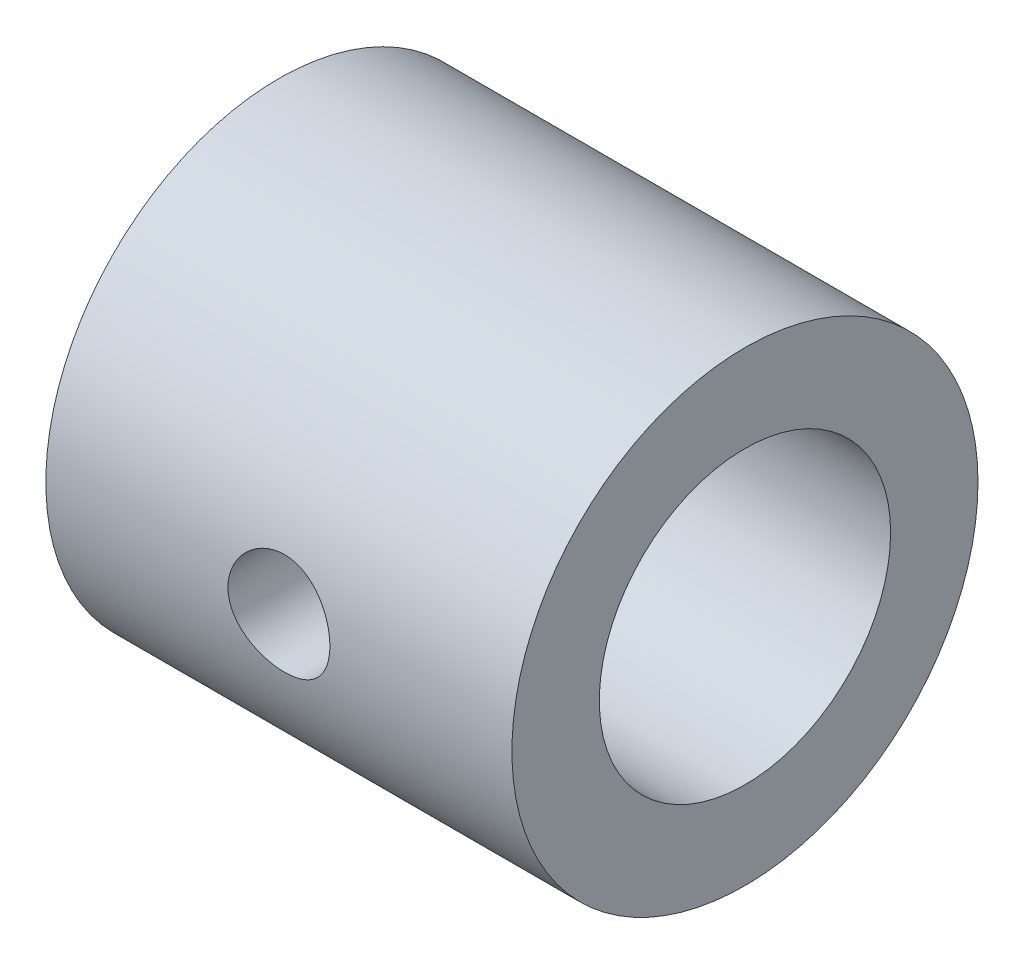
ISO-10303-21;
HEADER;
FILE_DESCRIPTION(('STEP AP214'),'2;1');
FILE_NAME('part.step','',(''),(''),'','','');
FILE_SCHEMA(('AUTOMOTIVE_DESIGN { 1 0 10303 214 1 1 1 1 }'));
ENDSEC;
DATA;
#1=APPLICATION_CONTEXT('core data for automotive mechanical design processes');
#2=APPLICATION_PROTOCOL_DEFINITION('international standard','automotive_design',2000,#1);
#3=PRODUCT_CONTEXT('',#1,'mechanical');
#4=PRODUCT('Part','Part','',(#3));
#5=PRODUCT_RELATED_PRODUCT_CATEGORY('part','',(#4));
#6=PRODUCT_DEFINITION_FORMATION('','',#4);
#7=PRODUCT_DEFINITION_CONTEXT('part definition',#1,'design');
#8=PRODUCT_DEFINITION('design','',#6,#7);
#9=PRODUCT_DEFINITION_SHAPE('','',#8);
#10=(LENGTH_UNIT() NAMED_UNIT(*) SI_UNIT(.MILLI.,.METRE.));
#11=(NAMED_UNIT(*) PLANE_ANGLE_UNIT() SI_UNIT($,.RADIAN.));
#12=(NAMED_UNIT(*) SI_UNIT($,.STERADIAN.) SOLID_ANGLE_UNIT());
#13=UNCERTAINTY_MEASURE_WITH_UNIT(LENGTH_MEASURE(1.E-05),#10,'distance_accuracy_value','');
#14=(GEOMETRIC_REPRESENTATION_CONTEXT(3) GLOBAL_UNCERTAINTY_ASSIGNED_CONTEXT((#13)) GLOBAL_UNIT_ASSIGNED_CONTEXT((#10,
#11,#12)) REPRESENTATION_CONTEXT('',''));
#15=CARTESIAN_POINT('',(0.,0.,0.));
#16=DIRECTION('',(0.,0.,1.));
#17=DIRECTION('',(1.,0.,0.));
#18=AXIS2_PLACEMENT_3D('',#15,#16,#17);
#19=CARTESIAN_POINT('',(6.35,0.,0.));
#20=DIRECTION('',(-1.,0.,0.));
#21=DIRECTION('',(0.,0.,1.));
#22=AXIS2_PLACEMENT_3D('',#19,#20,#21);
#23=CYLINDRICAL_SURFACE('',#22,6.35);
#24=CARTESIAN_POINT('',(1.3890625,0.,-6.35));
#25=CARTESIAN_POINT('',(1.38905986930336,-0.0770408471682831,-6.34999857899858));
#26=CARTESIAN_POINT('',(1.38263154808764,-0.154113483155263,-6.34858371582944));
#27=CARTESIAN_POINT('',(1.35711481436661,-0.306069518531249,-6.3430762080525));
#28=CARTESIAN_POINT('',(1.33801735654758,-0.380951313826296,-6.33898165026606));
#29=CARTESIAN_POINT('',(1.28778913742385,-0.526307623730005,-6.32857064766496));
#30=CARTESIAN_POINT('',(1.25667094696553,-0.596786653438425,-6.32225652460999));
#31=CARTESIAN_POINT('',(1.1833244870091,-0.73152084022531,-6.30808785716228));
#32=CARTESIAN_POINT('',(1.14109650464893,-0.795776158099904,-6.30023335258277));
#33=CARTESIAN_POINT('',(1.04601191719148,-0.917272723348734,-6.28370341003478));
#34=CARTESIAN_POINT('',(0.993011163737974,-0.974399782936221,-6.27501778865132));
#35=CARTESIAN_POINT('',(0.878194988507716,-1.07902809540525,-6.25787628862363));
#36=CARTESIAN_POINT('',(0.816378781488858,-1.12652848987194,-6.24942043052566));
#37=CARTESIAN_POINT('',(0.684842129817846,-1.21105894182183,-6.2335954457377));
#38=CARTESIAN_POINT('',(0.615041852226282,-1.24796743339354,-6.22623936751426));
#39=CARTESIAN_POINT('',(0.470042206653483,-1.30948659380819,-6.21359298291537));
#40=CARTESIAN_POINT('',(0.39484348560998,-1.33409873341496,-6.20830242949951));
#41=CARTESIAN_POINT('',(0.242420223312962,-1.36994915689751,-6.20048981569181));
#42=CARTESIAN_POINT('',(0.16524542191716,-1.38138961213299,-6.19792595162784));
#43=CARTESIAN_POINT('',(0.0100325548732576,-1.39120053912366,-6.19573145355588));
#44=CARTESIAN_POINT('',(-0.0680054034645996,-1.3895726177385,-6.19610045892848));
#45=CARTESIAN_POINT('',(-0.221226328488363,-1.37345569747506,-6.19969216119694));
#46=CARTESIAN_POINT('',(-0.296435406983452,-1.35920156493734,-6.20286274198083));
#47=CARTESIAN_POINT('',(-0.443368202127601,-1.31860894659746,-6.21161795094662));
#48=CARTESIAN_POINT('',(-0.515091722946607,-1.29226978268469,-6.21720271459119));
#49=CARTESIAN_POINT('',(-0.653677679092509,-1.22803912268215,-6.23020838169099));
#50=CARTESIAN_POINT('',(-0.720496865471805,-1.19005732002183,-6.23764354992541));
#51=CARTESIAN_POINT('',(-0.846900228836931,-1.10368304558917,-6.25350352055306));
#52=CARTESIAN_POINT('',(-0.906483417663659,-1.05528915442124,-6.26192845780233));
#53=CARTESIAN_POINT('',(-1.01807562481132,-0.948221191319587,-6.27904229219529));
#54=CARTESIAN_POINT('',(-1.06989294588232,-0.88934740731759,-6.28773295721028));
#55=CARTESIAN_POINT('',(-1.16294992406196,-0.763647218737209,-6.30423308338503));
#56=CARTESIAN_POINT('',(-1.20418938948675,-0.696820670076995,-6.31204252857457));
#57=CARTESIAN_POINT('',(-1.27496741262067,-0.55687789373565,-6.32592565886695));
#58=CARTESIAN_POINT('',(-1.30448084613331,-0.483748565062286,-6.33199560926044));
#59=CARTESIAN_POINT('',(-1.35074728815552,-0.333406298546856,-6.3416880672381));
#60=CARTESIAN_POINT('',(-1.36750215264408,-0.256193956405846,-6.34531093078939));
#61=CARTESIAN_POINT('',(-1.38749701371681,-0.101521759768157,-6.34965034804132));
#62=CARTESIAN_POINT('',(-1.39099887112832,-0.024097291437662,-6.35042320588568));
#63=CARTESIAN_POINT('',(-1.3850980810961,0.130230356866131,-6.34913331284916));
#64=CARTESIAN_POINT('',(-1.37569630910578,0.207133571848407,-6.34707075433855));
#65=CARTESIAN_POINT('',(-1.34447227224844,0.357368057618586,-6.34037731419124));
#66=CARTESIAN_POINT('',(-1.32278735806414,0.430729253025147,-6.33577484832666));
#67=CARTESIAN_POINT('',(-1.26776504916853,0.572772984759519,-6.32451674628277));
#68=CARTESIAN_POINT('',(-1.2344266615851,0.641455121837125,-6.31786093516479));
#69=CARTESIAN_POINT('',(-1.1564981841587,0.773273856447654,-6.30309556357787));
#70=CARTESIAN_POINT('',(-1.11175426656689,0.836317293289701,-6.29496660673028));
#71=CARTESIAN_POINT('',(-1.01248740912607,0.954094899266631,-6.27819624848666));
#72=CARTESIAN_POINT('',(-0.957963198937231,1.00882798728205,-6.26955478061946));
#73=CARTESIAN_POINT('',(-0.839481887748859,1.10946652714324,-6.2525388718201));
#74=CARTESIAN_POINT('',(-0.775369430407147,1.15519065365343,-6.24417228961643));
#75=CARTESIAN_POINT('',(-0.640221621913181,1.23522363853578,-6.22883534751375));
#76=CARTESIAN_POINT('',(-0.569186570476502,1.26953299083004,-6.22186492720743));
#77=CARTESIAN_POINT('',(-0.422590884458291,1.3255308249353,-6.21017608603567));
#78=CARTESIAN_POINT('',(-0.347058412702929,1.34729026638093,-6.2054450311924));
#79=CARTESIAN_POINT('',(-0.193292408816776,1.3777784494499,-6.19874782905592));
#80=CARTESIAN_POINT('',(-0.11505931076456,1.38650927531006,-6.19678123952368));
#81=CARTESIAN_POINT('',(0.0400589152149301,1.39060367444849,-6.19586350318036));
#82=CARTESIAN_POINT('',(0.116936210133745,1.38625475155461,-6.1968474986074));
#83=CARTESIAN_POINT('',(0.268834094583135,1.36495585245806,-6.20157337782062));
#84=CARTESIAN_POINT('',(0.343854705991454,1.34800602480797,-6.20531522909432));
#85=CARTESIAN_POINT('',(0.489681227612941,1.30212537285486,-6.21510358904485));
#86=CARTESIAN_POINT('',(0.560500881292062,1.2732363980058,-6.22114204176945));
#87=CARTESIAN_POINT('',(0.696330912671777,1.20433345118798,-6.23484638338867));
#88=CARTESIAN_POINT('',(0.761340684063724,1.16431831990124,-6.24251244185608));
#89=CARTESIAN_POINT('',(0.885122807803415,1.07334538224577,-6.25880195994543));
#90=CARTESIAN_POINT('',(0.943742472514475,1.0221826878529,-6.2674416430782));
#91=CARTESIAN_POINT('',(1.05165862099773,0.910782131259334,-6.28459592080665));
#92=CARTESIAN_POINT('',(1.10095294642711,0.850542173914802,-6.29311048602432));
#93=CARTESIAN_POINT('',(1.18943146578896,0.721755121796878,-6.30918620130407));
#94=CARTESIAN_POINT('',(1.22847616949484,0.653110375924711,-6.31673354607912));
#95=CARTESIAN_POINT('',(1.29441154342387,0.51008183430329,-6.3298859198831));
#96=CARTESIAN_POINT('',(1.3213124050221,0.435702912410396,-6.3354925766542));
#97=CARTESIAN_POINT('',(1.35740301626477,0.301041738185885,-6.34313167188264));
#98=CARTESIAN_POINT('',(1.36925266606876,0.241487886914347,-6.34569133939321));
#99=CARTESIAN_POINT('',(1.38508326916996,0.121295893746684,-6.34912602552347));
#100=CARTESIAN_POINT('',(1.38906457126838,0.0606578000349113,-6.35000111881973));
#101=CARTESIAN_POINT('',(1.3890625,0.,-6.35));
#102=B_SPLINE_CURVE_WITH_KNOTS('',3,(#24,#25,#26,#27,#28,#29,#30,#31,#32,#33,#34,#35,#36,#37,
#38,#39,#40,#41,#42,#43,#44,#45,#46,#47,#48,#49,#50,#51,#52,#53,#54,#55,#56,#57,#58,#59,#60,#61,
#62,#63,#64,#65,#66,#67,#68,#69,#70,#71,#72,#73,#74,#75,#76,#77,#78,#79,#80,#81,#82,#83,#84,#85,
#86,#87,#88,#89,#90,#91,#92,#93,#94,#95,#96,#97,#98,#99,#100,#101),.UNSPECIFIED.,.T.,.F.,(4,2,2,
2,2,2,2,2,2,2,2,2,2,2,2,2,2,2,2,2,2,2,2,2,2,2,2,2,2,2,2,2,2,2,2,2,2,2,4),(0.,0.230900509144249,
0.4619660507311,0.692790603672132,0.923609191426884,1.15774795204596,1.39190758176553,
1.62865607320934,1.86537624043712,2.09841242042367,2.33141994721875,2.56018212935158,
2.78895714926963,3.01955360668713,3.25018151938973,3.48579772155466,3.72141819307559,
3.95754081719481,4.19362908617659,4.42502746626468,4.65641014778622,4.88525517593931,
5.11411970636799,5.34625135018098,5.57841316690404,5.81485460555447,6.05128581195316,
6.28636674309187,6.5214100634136,6.75132496959778,6.98123716534878,7.21035021078305,
7.43948713818205,7.67325690109678,7.90708070382927,8.14393862784679,8.38059740434398,
8.5624040477739,8.74420263159577),.UNSPECIFIED.);
#103=CARTESIAN_POINT('',(1.3890625,0.,-6.35));
#104=VERTEX_POINT('',#103);
#105=EDGE_CURVE('E386',#104,#104,#102,.T.);
#106=ORIENTED_EDGE('',*,*,#105,.F.);
#107=EDGE_LOOP('',(#106));
#108=FACE_BOUND('',#107,.T.);
#109=CARTESIAN_POINT('',(-6.35,0.,0.));
#110=DIRECTION('',(1.,0.,0.));
#111=DIRECTION('',(0.,0.,-1.));
#112=AXIS2_PLACEMENT_3D('',#109,#110,#111);
#113=CIRCLE('',#112,6.35);
#114=CARTESIAN_POINT('',(-6.35,0.,-6.35));
#115=VERTEX_POINT('',#114);
#116=EDGE_CURVE('E369',#115,#115,#113,.T.);
#117=ORIENTED_EDGE('',*,*,#116,.T.);
#118=EDGE_LOOP('',(#117));
#119=FACE_BOUND('',#118,.T.);
#120=CARTESIAN_POINT('',(6.35,0.,0.));
#121=DIRECTION('',(1.,0.,0.));
#122=DIRECTION('',(0.,0.,-1.));
#123=AXIS2_PLACEMENT_3D('',#120,#121,#122);
#124=CIRCLE('',#123,6.35);
#125=CARTESIAN_POINT('',(6.35,0.,-6.35));
#126=VERTEX_POINT('',#125);
#127=EDGE_CURVE('E10',#126,#126,#124,.T.);
#128=ORIENTED_EDGE('',*,*,#127,.F.);
#129=EDGE_LOOP('',(#128));
#130=FACE_BOUND('',#129,.T.);
#131=CARTESIAN_POINT('',(-1.3890625,0.,6.35));
#132=CARTESIAN_POINT('',(-1.38905986930336,0.0770408471682831,6.34999857899858));
#133=CARTESIAN_POINT('',(-1.38263154808764,0.154113483155263,6.34858371582944));
#134=CARTESIAN_POINT('',(-1.35711481436661,0.306069518531249,6.3430762080525));
#135=CARTESIAN_POINT('',(-1.33801735654758,0.380951313826296,6.33898165026606));
#136=CARTESIAN_POINT('',(-1.28778913742385,0.526307623730005,6.32857064766496));
#137=CARTESIAN_POINT('',(-1.25667094696553,0.596786653438425,6.32225652460999));
#138=CARTESIAN_POINT('',(-1.1833244870091,0.73152084022531,6.30808785716228));
#139=CARTESIAN_POINT('',(-1.14109650464893,0.795776158099904,6.30023335258277));
#140=CARTESIAN_POINT('',(-1.04601191719148,0.917272723348734,6.28370341003478));
#141=CARTESIAN_POINT('',(-0.993011163737974,0.974399782936221,6.27501778865132));
#142=CARTESIAN_POINT('',(-0.878194988507716,1.07902809540525,6.25787628862363));
#143=CARTESIAN_POINT('',(-0.816378781488858,1.12652848987194,6.24942043052566));
#144=CARTESIAN_POINT('',(-0.684842129817846,1.21105894182183,6.2335954457377));
#145=CARTESIAN_POINT('',(-0.615041852226282,1.24796743339354,6.22623936751426));
#146=CARTESIAN_POINT('',(-0.470042206653483,1.30948659380819,6.21359298291537));
#147=CARTESIAN_POINT('',(-0.39484348560998,1.33409873341496,6.20830242949951));
#148=CARTESIAN_POINT('',(-0.242420223312962,1.36994915689751,6.20048981569181));
#149=CARTESIAN_POINT('',(-0.16524542191716,1.38138961213299,6.19792595162784));
#150=CARTESIAN_POINT('',(-0.0100325548732576,1.39120053912366,6.19573145355588));
#151=CARTESIAN_POINT('',(0.0680054034645996,1.3895726177385,6.19610045892848));
#152=CARTESIAN_POINT('',(0.221226328488363,1.37345569747506,6.19969216119694));
#153=CARTESIAN_POINT('',(0.296435406983452,1.35920156493734,6.20286274198083));
#154=CARTESIAN_POINT('',(0.443368202127601,1.31860894659746,6.21161795094662));
#155=CARTESIAN_POINT('',(0.515091722946607,1.29226978268469,6.21720271459119));
#156=CARTESIAN_POINT('',(0.653677679092509,1.22803912268215,6.23020838169099));
#157=CARTESIAN_POINT('',(0.720496865471805,1.19005732002183,6.23764354992541));
#158=CARTESIAN_POINT('',(0.846900228836931,1.10368304558917,6.25350352055306));
#159=CARTESIAN_POINT('',(0.906483417663659,1.05528915442124,6.26192845780233));
#160=CARTESIAN_POINT('',(1.01807562481132,0.948221191319587,6.27904229219529));
#161=CARTESIAN_POINT('',(1.06989294588232,0.88934740731759,6.28773295721028));
#162=CARTESIAN_POINT('',(1.16294992406196,0.763647218737209,6.30423308338503));
#163=CARTESIAN_POINT('',(1.20418938948675,0.696820670076995,6.31204252857457));
#164=CARTESIAN_POINT('',(1.27496741262067,0.55687789373565,6.32592565886695));
#165=CARTESIAN_POINT('',(1.30448084613331,0.483748565062286,6.33199560926044));
#166=CARTESIAN_POINT('',(1.35074728815552,0.333406298546856,6.3416880672381));
#167=CARTESIAN_POINT('',(1.36750215264408,0.256193956405846,6.34531093078939));
#168=CARTESIAN_POINT('',(1.38749701371681,0.101521759768157,6.34965034804132));
#169=CARTESIAN_POINT('',(1.39099887112832,0.024097291437662,6.35042320588568));
#170=CARTESIAN_POINT('',(1.3850980810961,-0.130230356866131,6.34913331284916));
#171=CARTESIAN_POINT('',(1.37569630910578,-0.207133571848407,6.34707075433855));
#172=CARTESIAN_POINT('',(1.34447227224844,-0.357368057618586,6.34037731419124));
#173=CARTESIAN_POINT('',(1.32278735806414,-0.430729253025147,6.33577484832666));
#174=CARTESIAN_POINT('',(1.26776504916853,-0.572772984759519,6.32451674628277));
#175=CARTESIAN_POINT('',(1.2344266615851,-0.641455121837125,6.31786093516479));
#176=CARTESIAN_POINT('',(1.1564981841587,-0.773273856447654,6.30309556357787));
#177=CARTESIAN_POINT('',(1.11175426656689,-0.836317293289701,6.29496660673028));
#178=CARTESIAN_POINT('',(1.01248740912607,-0.954094899266631,6.27819624848666));
#179=CARTESIAN_POINT('',(0.957963198937231,-1.00882798728205,6.26955478061946));
#180=CARTESIAN_POINT('',(0.839481887748859,-1.10946652714324,6.2525388718201));
#181=CARTESIAN_POINT('',(0.775369430407147,-1.15519065365343,6.24417228961643));
#182=CARTESIAN_POINT('',(0.640221621913181,-1.23522363853578,6.22883534751375));
#183=CARTESIAN_POINT('',(0.569186570476502,-1.26953299083004,6.22186492720743));
#184=CARTESIAN_POINT('',(0.422590884458291,-1.3255308249353,6.21017608603567));
#185=CARTESIAN_POINT('',(0.347058412702929,-1.34729026638093,6.2054450311924));
#186=CARTESIAN_POINT('',(0.193292408816776,-1.3777784494499,6.19874782905592));
#187=CARTESIAN_POINT('',(0.11505931076456,-1.38650927531006,6.19678123952368));
#188=CARTESIAN_POINT('',(-0.0400589152149301,-1.39060367444849,6.19586350318036));
#189=CARTESIAN_POINT('',(-0.116936210133745,-1.38625475155461,6.1968474986074));
#190=CARTESIAN_POINT('',(-0.268834094583135,-1.36495585245806,6.20157337782062));
#191=CARTESIAN_POINT('',(-0.343854705991454,-1.34800602480797,6.20531522909432));
#192=CARTESIAN_POINT('',(-0.489681227612941,-1.30212537285486,6.21510358904485));
#193=CARTESIAN_POINT('',(-0.560500881292062,-1.2732363980058,6.22114204176945));
#194=CARTESIAN_POINT('',(-0.696330912671777,-1.20433345118798,6.23484638338867));
#195=CARTESIAN_POINT('',(-0.761340684063724,-1.16431831990124,6.24251244185608));
#196=CARTESIAN_POINT('',(-0.885122807803415,-1.07334538224577,6.25880195994543));
#197=CARTESIAN_POINT('',(-0.943742472514475,-1.0221826878529,6.2674416430782));
#198=CARTESIAN_POINT('',(-1.05165862099773,-0.910782131259334,6.28459592080665));
#199=CARTESIAN_POINT('',(-1.10095294642711,-0.850542173914802,6.29311048602432));
#200=CARTESIAN_POINT('',(-1.18943146578896,-0.721755121796878,6.30918620130407));
#201=CARTESIAN_POINT('',(-1.22847616949484,-0.653110375924711,6.31673354607912));
#202=CARTESIAN_POINT('',(-1.29441154342387,-0.51008183430329,6.3298859198831));
#203=CARTESIAN_POINT('',(-1.3213124050221,-0.435702912410396,6.3354925766542));
#204=CARTESIAN_POINT('',(-1.35740301626477,-0.301041738185885,6.34313167188264));
#205=CARTESIAN_POINT('',(-1.36925266606876,-0.241487886914347,6.34569133939321));
#206=CARTESIAN_POINT('',(-1.38508326916996,-0.121295893746684,6.34912602552347));
#207=CARTESIAN_POINT('',(-1.38906457126838,-0.0606578000349113,6.35000111881973));
#208=CARTESIAN_POINT('',(-1.3890625,0.,6.35));
#209=B_SPLINE_CURVE_WITH_KNOTS('',3,(#131,#132,#133,#134,#135,#136,#137,#138,#139,#140,#141,
#142,#143,#144,#145,#146,#147,#148,#149,#150,#151,#152,#153,#154,#155,#156,#157,#158,#159,#160,
#161,#162,#163,#164,#165,#166,#167,#168,#169,#170,#171,#172,#173,#174,#175,#176,#177,#178,#179,
#180,#181,#182,#183,#184,#185,#186,#187,#188,#189,#190,#191,#192,#193,#194,#195,#196,#197,#198,
#199,#200,#201,#202,#203,#204,#205,#206,#207,#208),.UNSPECIFIED.,.T.,.F.,(4,2,2,2,2,2,2,2,2,2,2,
2,2,2,2,2,2,2,2,2,2,2,2,2,2,2,2,2,2,2,2,2,2,2,2,2,2,2,4),(0.,0.230900509144249,0.4619660507311,
0.692790603672132,0.923609191426884,1.15774795204596,1.39190758176553,1.62865607320934,
1.86537624043712,2.09841242042367,2.33141994721875,2.56018212935158,2.78895714926963,
3.01955360668713,3.25018151938973,3.48579772155466,3.72141819307559,3.95754081719481,
4.19362908617659,4.42502746626468,4.65641014778622,4.88525517593931,5.11411970636799,
5.34625135018098,5.57841316690404,5.81485460555447,6.05128581195316,6.28636674309187,
6.5214100634136,6.75132496959778,6.98123716534878,7.21035021078305,7.43948713818205,
7.67325690109678,7.90708070382927,8.14393862784679,8.38059740434398,8.5624040477739,
8.74420263159577),.UNSPECIFIED.);
#210=CARTESIAN_POINT('',(-1.3890625,0.,6.35));
#211=VERTEX_POINT('',#210);
#212=EDGE_CURVE('E379',#211,#211,#209,.T.);
#213=ORIENTED_EDGE('',*,*,#212,.T.);
#214=EDGE_LOOP('',(#213));
#215=FACE_BOUND('',#214,.T.);
#216=ADVANCED_FACE('F359',(#108,#119,#130,#215),#23,.T.);
#217=CARTESIAN_POINT('',(6.35,0.,0.));
#218=DIRECTION('',(-1.,0.,0.));
#219=DIRECTION('',(0.,0.,1.));
#220=AXIS2_PLACEMENT_3D('',#217,#218,#219);
#221=CYLINDRICAL_SURFACE('',#220,3.96875);
#222=CARTESIAN_POINT('',(1.3890625,0.,-3.96875));
#223=CARTESIAN_POINT('',(1.38906367342023,-0.0755726857493698,-3.96875082338149));
#224=CARTESIAN_POINT('',(1.382875349161,-0.151136993574778,-3.96657194121773));
#225=CARTESIAN_POINT('',(1.35837065083875,-0.30002692692016,-3.95809570905545));
#226=CARTESIAN_POINT('',(1.34005422264958,-0.373352542447613,-3.95179834067667));
#227=CARTESIAN_POINT('',(1.29200714003203,-0.515597122543886,-3.93576622247314));
#228=CARTESIAN_POINT('',(1.2622967238091,-0.58452364908524,-3.92603756980394));
#229=CARTESIAN_POINT('',(1.19240097146709,-0.716413606101389,-3.90412644580919));
#230=CARTESIAN_POINT('',(1.1522132542417,-0.779375676633807,-3.89194341683714));
#231=CARTESIAN_POINT('',(1.06091493285112,-0.899924338408635,-3.86588245014876));
#232=CARTESIAN_POINT('',(1.00947937620547,-0.957255342264287,-3.85196096580268));
#233=CARTESIAN_POINT('',(0.897835759511502,-1.06267720356907,-3.82422159868389));
#234=CARTESIAN_POINT('',(0.83762549935231,-1.11076573658976,-3.81040374281063));
#235=CARTESIAN_POINT('',(0.707765185956404,-1.19785985835571,-3.78394656203395));
#236=CARTESIAN_POINT('',(0.6378731533615,-1.23652213746331,-3.77135967897728));
#237=CARTESIAN_POINT('',(0.492067615728175,-1.30143223125416,-3.7494576884965));
#238=CARTESIAN_POINT('',(0.41615617545043,-1.32768428153326,-3.74014146508008));
#239=CARTESIAN_POINT('',(0.263388858904462,-1.36605025608135,-3.7262968255319));
#240=CARTESIAN_POINT('',(0.186669403324068,-1.37864678214462,-3.72160555023886));
#241=CARTESIAN_POINT('',(0.0320734059286924,-1.39085319116506,-3.71706208213636));
#242=CARTESIAN_POINT('',(-0.0458027243964361,-1.39046758693956,-3.71720820776076));
#243=CARTESIAN_POINT('',(-0.196274316494031,-1.37709314648088,-3.72218119402336));
#244=CARTESIAN_POINT('',(-0.268936382798948,-1.36474880681299,-3.72676868642454));
#245=CARTESIAN_POINT('',(-0.411084079996758,-1.32886413611458,-3.73971345556141));
#246=CARTESIAN_POINT('',(-0.480569292354336,-1.30532233450428,-3.74807122744623));
#247=CARTESIAN_POINT('',(-0.615796158065304,-1.24731609777272,-3.7677749237607));
#248=CARTESIAN_POINT('',(-0.681452453191412,-1.21267007849031,-3.77916995329591));
#249=CARTESIAN_POINT('',(-0.806216617253372,-1.13356504499636,-3.80364528863999));
#250=CARTESIAN_POINT('',(-0.865322435374316,-1.08910297054944,-3.81672611948064));
#251=CARTESIAN_POINT('',(-0.978909343759119,-0.988589429339546,-3.84402505145878));
#252=CARTESIAN_POINT('',(-1.03292403966465,-0.932015724873201,-3.85826513256295));
#253=CARTESIAN_POINT('',(-1.13082779290598,-0.810441311254566,-3.88561953381683));
#254=CARTESIAN_POINT('',(-1.17471566958646,-0.745439620887249,-3.89873372259034));
#255=CARTESIAN_POINT('',(-1.25154769027897,-0.607788158118898,-3.92256293117214));
#256=CARTESIAN_POINT('',(-1.28435519197042,-0.535056478228505,-3.9332474992284));
#257=CARTESIAN_POINT('',(-1.33712041553764,-0.38464138486792,-3.95079093934098));
#258=CARTESIAN_POINT('',(-1.35708307956873,-0.306959888538396,-3.95765128266277));
#259=CARTESIAN_POINT('',(-1.38273861970177,-0.152789748586063,-3.96652377002134));
#260=CARTESIAN_POINT('',(-1.3890608357122,-0.0764180028925928,-3.96874956012529));
#261=CARTESIAN_POINT('',(-1.38906416264514,0.0763176680552506,-3.96875043932669));
#262=CARTESIAN_POINT('',(-1.38274765858882,0.152681592066135,-3.96652636814632));
#263=CARTESIAN_POINT('',(-1.35814381425699,0.300637691964448,-3.95801862827158));
#264=CARTESIAN_POINT('',(-1.34025277346199,0.37230428118643,-3.95186944108398));
#265=CARTESIAN_POINT('',(-1.29351332971135,0.511581814407692,-3.9362641544961));
#266=CARTESIAN_POINT('',(-1.26466350894293,0.579192232321028,-3.92680762721501));
#267=CARTESIAN_POINT('',(-1.19594705857439,0.710528009109254,-3.90521200036048));
#268=CARTESIAN_POINT('',(-1.15579763732079,0.774094067630814,-3.89300590393137));
#269=CARTESIAN_POINT('',(-1.06594863185691,0.893785434447258,-3.86728302244723));
#270=CARTESIAN_POINT('',(-1.01624587667363,0.949908261678748,-3.85376580294006));
#271=CARTESIAN_POINT('',(-0.90574804498442,1.05606578291593,-3.82607677015545));
#272=CARTESIAN_POINT('',(-0.844520588396698,1.10565188429835,-3.81190625246307));
#273=CARTESIAN_POINT('',(-0.714317096175692,1.19391407229585,-3.78519205292869));
#274=CARTESIAN_POINT('',(-0.645340788793842,1.2325897761213,-3.77264842817432));
#275=CARTESIAN_POINT('',(-0.501385169198903,1.29782483274576,-3.75070907745572));
#276=CARTESIAN_POINT('',(-0.426405734841468,1.32438393893727,-3.74131341556259));
#277=CARTESIAN_POINT('',(-0.272627147988859,1.36435769080645,-3.72692430756948));
#278=CARTESIAN_POINT('',(-0.193829977245448,1.37777908103221,-3.72192860278269));
#279=CARTESIAN_POINT('',(-0.0394413098879486,1.39053863407983,-3.7171791172389));
#280=CARTESIAN_POINT('',(0.0360800239970055,1.39062908778607,-3.71714532636704));
#281=CARTESIAN_POINT('',(0.186000478565672,1.3786052407157,-3.72162120337294));
#282=CARTESIAN_POINT('',(0.260399679488336,1.36649181682617,-3.72613054481234));
#283=CARTESIAN_POINT('',(0.404237411751064,1.33095862339333,-3.73896609809783));
#284=CARTESIAN_POINT('',(0.473750864901311,1.30780673208454,-3.74720165333875));
#285=CARTESIAN_POINT('',(0.607956181376493,1.25107747457774,-3.76652031834672));
#286=CARTESIAN_POINT('',(0.672646905611636,1.21749765500041,-3.77760409810974));
#287=CARTESIAN_POINT('',(0.798684972108818,1.13901942589759,-3.80202231914922));
#288=CARTESIAN_POINT('',(0.859730230704957,1.0936614553722,-3.81543831856734));
#289=CARTESIAN_POINT('',(0.973585027633772,0.993665467000821,-3.84269282207074));
#290=CARTESIAN_POINT('',(1.02639211665064,0.939024699306065,-3.85653145035237));
#291=CARTESIAN_POINT('',(1.12465793836776,0.819091724873983,-3.883813469686));
#292=CARTESIAN_POINT('',(1.16968367254593,0.75343304776808,-3.89721167616729));
#293=CARTESIAN_POINT('',(1.24802244968908,0.615024340292446,-3.92143466636842));
#294=CARTESIAN_POINT('',(1.28133704390723,0.542275250747824,-3.93225979085616));
#295=CARTESIAN_POINT('',(1.33479270880697,0.392521216847746,-3.95000274028422));
#296=CARTESIAN_POINT('',(1.35507277902626,0.315571007419227,-3.95696168172637));
#297=CARTESIAN_POINT('',(1.38220469248642,0.159076823230867,-3.96633407787303));
#298=CARTESIAN_POINT('',(1.38906126507582,0.0795337720226374,-3.96874913346158));
#299=CARTESIAN_POINT('',(1.3890625,0.,-3.96875));
#300=B_SPLINE_CURVE_WITH_KNOTS('',3,(#222,#223,#224,#225,#226,#227,#228,#229,#230,#231,#232,
#233,#234,#235,#236,#237,#238,#239,#240,#241,#242,#243,#244,#245,#246,#247,#248,#249,#250,#251,
#252,#253,#254,#255,#256,#257,#258,#259,#260,#261,#262,#263,#264,#265,#266,#267,#268,#269,#270,
#271,#272,#273,#274,#275,#276,#277,#278,#279,#280,#281,#282,#283,#284,#285,#286,#287,#288,#289,
#290,#291,#292,#293,#294,#295,#296,#297,#298,#299),.UNSPECIFIED.,.T.,.F.,(4,2,2,2,2,2,2,2,2,2,2,
2,2,2,2,2,2,2,2,2,2,2,2,2,2,2,2,2,2,2,2,2,2,2,2,2,2,2,4),(0.,0.226425102787469,
0.452851216087628,0.678876996193797,0.904954188516879,1.13871887009607,1.3725422654438,
1.61391355715673,1.85520240956247,2.08765391585535,2.32002461874162,2.54053102087355,
2.76106639044753,2.98540978830693,3.20982322606652,3.44723950734072,3.68468345429389,
3.92495688463962,4.16513781246936,4.39397677936361,4.62277256670299,4.84412185662826,
5.06549979379358,5.29300431153105,5.52058447410476,5.75961897204454,5.99866185543054,
6.23770960380778,6.47663456707303,6.70207105017428,6.92749133610905,7.14769989589139,
7.36796030345579,7.59862062508932,7.82934939489826,8.07037287847646,8.31136442413473,
8.54974143054033,8.78803443715683),.UNSPECIFIED.);
#301=CARTESIAN_POINT('',(1.3890625,0.,-3.96875));
#302=VERTEX_POINT('',#301);
#303=EDGE_CURVE('E406',#302,#302,#300,.T.);
#304=ORIENTED_EDGE('',*,*,#303,.T.);
#305=EDGE_LOOP('',(#304));
#306=FACE_BOUND('',#305,.T.);
#307=CARTESIAN_POINT('',(-6.35,0.,0.));
#308=DIRECTION('',(1.,0.,0.));
#309=DIRECTION('',(0.,0.,-1.));
#310=AXIS2_PLACEMENT_3D('',#307,#308,#309);
#311=CIRCLE('',#310,3.96875);
#312=CARTESIAN_POINT('',(-6.35,0.,-3.96875));
#313=VERTEX_POINT('',#312);
#314=EDGE_CURVE('E373',#313,#313,#311,.T.);
#315=ORIENTED_EDGE('',*,*,#314,.F.);
#316=EDGE_LOOP('',(#315));
#317=FACE_BOUND('',#316,.T.);
#318=CARTESIAN_POINT('',(6.35,0.,0.));
#319=DIRECTION('',(1.,0.,0.));
#320=DIRECTION('',(0.,0.,-1.));
#321=AXIS2_PLACEMENT_3D('',#318,#319,#320);
#322=CIRCLE('',#321,3.96875);
#323=CARTESIAN_POINT('',(6.35,0.,-3.96875));
#324=VERTEX_POINT('',#323);
#325=EDGE_CURVE('E365',#324,#324,#322,.T.);
#326=ORIENTED_EDGE('',*,*,#325,.T.);
#327=EDGE_LOOP('',(#326));
#328=FACE_BOUND('',#327,.T.);
#329=CARTESIAN_POINT('',(-1.3890625,0.,3.96875));
#330=CARTESIAN_POINT('',(-1.38906367342023,0.0755726857493698,3.96875082338149));
#331=CARTESIAN_POINT('',(-1.382875349161,0.151136993574778,3.96657194121773));
#332=CARTESIAN_POINT('',(-1.35837065083875,0.30002692692016,3.95809570905545));
#333=CARTESIAN_POINT('',(-1.34005422264958,0.373352542447613,3.95179834067667));
#334=CARTESIAN_POINT('',(-1.29200714003203,0.515597122543886,3.93576622247314));
#335=CARTESIAN_POINT('',(-1.2622967238091,0.58452364908524,3.92603756980394));
#336=CARTESIAN_POINT('',(-1.19240097146709,0.716413606101389,3.90412644580919));
#337=CARTESIAN_POINT('',(-1.1522132542417,0.779375676633807,3.89194341683714));
#338=CARTESIAN_POINT('',(-1.06091493285112,0.899924338408635,3.86588245014876));
#339=CARTESIAN_POINT('',(-1.00947937620547,0.957255342264287,3.85196096580268));
#340=CARTESIAN_POINT('',(-0.897835759511502,1.06267720356907,3.82422159868389));
#341=CARTESIAN_POINT('',(-0.83762549935231,1.11076573658976,3.81040374281063));
#342=CARTESIAN_POINT('',(-0.707765185956404,1.19785985835571,3.78394656203395));
#343=CARTESIAN_POINT('',(-0.6378731533615,1.23652213746331,3.77135967897728));
#344=CARTESIAN_POINT('',(-0.492067615728175,1.30143223125416,3.7494576884965));
#345=CARTESIAN_POINT('',(-0.41615617545043,1.32768428153326,3.74014146508008));
#346=CARTESIAN_POINT('',(-0.263388858904462,1.36605025608135,3.7262968255319));
#347=CARTESIAN_POINT('',(-0.186669403324068,1.37864678214462,3.72160555023886));
#348=CARTESIAN_POINT('',(-0.0320734059286924,1.39085319116506,3.71706208213636));
#349=CARTESIAN_POINT('',(0.0458027243964361,1.39046758693956,3.71720820776076));
#350=CARTESIAN_POINT('',(0.196274316494031,1.37709314648088,3.72218119402336));
#351=CARTESIAN_POINT('',(0.268936382798948,1.36474880681299,3.72676868642454));
#352=CARTESIAN_POINT('',(0.411084079996758,1.32886413611458,3.73971345556141));
#353=CARTESIAN_POINT('',(0.480569292354336,1.30532233450428,3.74807122744623));
#354=CARTESIAN_POINT('',(0.615796158065304,1.24731609777272,3.7677749237607));
#355=CARTESIAN_POINT('',(0.681452453191412,1.21267007849031,3.77916995329591));
#356=CARTESIAN_POINT('',(0.806216617253372,1.13356504499636,3.80364528863999));
#357=CARTESIAN_POINT('',(0.865322435374316,1.08910297054944,3.81672611948064));
#358=CARTESIAN_POINT('',(0.978909343759119,0.988589429339546,3.84402505145878));
#359=CARTESIAN_POINT('',(1.03292403966465,0.932015724873201,3.85826513256295));
#360=CARTESIAN_POINT('',(1.13082779290598,0.810441311254566,3.88561953381683));
#361=CARTESIAN_POINT('',(1.17471566958646,0.745439620887249,3.89873372259034));
#362=CARTESIAN_POINT('',(1.25154769027897,0.607788158118898,3.92256293117214));
#363=CARTESIAN_POINT('',(1.28435519197042,0.535056478228505,3.9332474992284));
#364=CARTESIAN_POINT('',(1.33712041553764,0.38464138486792,3.95079093934098));
#365=CARTESIAN_POINT('',(1.35708307956873,0.306959888538396,3.95765128266277));
#366=CARTESIAN_POINT('',(1.38273861970177,0.152789748586063,3.96652377002134));
#367=CARTESIAN_POINT('',(1.3890608357122,0.0764180028925928,3.96874956012529));
#368=CARTESIAN_POINT('',(1.38906416264514,-0.0763176680552506,3.96875043932669));
#369=CARTESIAN_POINT('',(1.38274765858882,-0.152681592066135,3.96652636814632));
#370=CARTESIAN_POINT('',(1.35814381425699,-0.300637691964448,3.95801862827158));
#371=CARTESIAN_POINT('',(1.34025277346199,-0.37230428118643,3.95186944108398));
#372=CARTESIAN_POINT('',(1.29351332971135,-0.511581814407692,3.9362641544961));
#373=CARTESIAN_POINT('',(1.26466350894293,-0.579192232321028,3.92680762721501));
#374=CARTESIAN_POINT('',(1.19594705857439,-0.710528009109254,3.90521200036048));
#375=CARTESIAN_POINT('',(1.15579763732079,-0.774094067630814,3.89300590393137));
#376=CARTESIAN_POINT('',(1.06594863185691,-0.893785434447258,3.86728302244723));
#377=CARTESIAN_POINT('',(1.01624587667363,-0.949908261678748,3.85376580294006));
#378=CARTESIAN_POINT('',(0.90574804498442,-1.05606578291593,3.82607677015545));
#379=CARTESIAN_POINT('',(0.844520588396698,-1.10565188429835,3.81190625246307));
#380=CARTESIAN_POINT('',(0.714317096175692,-1.19391407229585,3.78519205292869));
#381=CARTESIAN_POINT('',(0.645340788793842,-1.2325897761213,3.77264842817432));
#382=CARTESIAN_POINT('',(0.501385169198903,-1.29782483274576,3.75070907745572));
#383=CARTESIAN_POINT('',(0.426405734841468,-1.32438393893727,3.74131341556259));
#384=CARTESIAN_POINT('',(0.272627147988859,-1.36435769080645,3.72692430756948));
#385=CARTESIAN_POINT('',(0.193829977245448,-1.37777908103221,3.72192860278269));
#386=CARTESIAN_POINT('',(0.0394413098879486,-1.39053863407983,3.7171791172389));
#387=CARTESIAN_POINT('',(-0.0360800239970055,-1.39062908778607,3.71714532636704));
#388=CARTESIAN_POINT('',(-0.186000478565672,-1.3786052407157,3.72162120337294));
#389=CARTESIAN_POINT('',(-0.260399679488336,-1.36649181682617,3.72613054481234));
#390=CARTESIAN_POINT('',(-0.404237411751064,-1.33095862339333,3.73896609809783));
#391=CARTESIAN_POINT('',(-0.473750864901311,-1.30780673208454,3.74720165333875));
#392=CARTESIAN_POINT('',(-0.607956181376493,-1.25107747457774,3.76652031834672));
#393=CARTESIAN_POINT('',(-0.672646905611636,-1.21749765500041,3.77760409810974));
#394=CARTESIAN_POINT('',(-0.798684972108818,-1.13901942589759,3.80202231914922));
#395=CARTESIAN_POINT('',(-0.859730230704957,-1.0936614553722,3.81543831856734));
#396=CARTESIAN_POINT('',(-0.973585027633772,-0.993665467000821,3.84269282207074));
#397=CARTESIAN_POINT('',(-1.02639211665064,-0.939024699306065,3.85653145035237));
#398=CARTESIAN_POINT('',(-1.12465793836776,-0.819091724873983,3.883813469686));
#399=CARTESIAN_POINT('',(-1.16968367254593,-0.75343304776808,3.89721167616729));
#400=CARTESIAN_POINT('',(-1.24802244968908,-0.615024340292446,3.92143466636842));
#401=CARTESIAN_POINT('',(-1.28133704390723,-0.542275250747824,3.93225979085616));
#402=CARTESIAN_POINT('',(-1.33479270880697,-0.392521216847746,3.95000274028422));
#403=CARTESIAN_POINT('',(-1.35507277902626,-0.315571007419227,3.95696168172637));
#404=CARTESIAN_POINT('',(-1.38220469248642,-0.159076823230867,3.96633407787303));
#405=CARTESIAN_POINT('',(-1.38906126507582,-0.0795337720226374,3.96874913346158));
#406=CARTESIAN_POINT('',(-1.3890625,0.,3.96875));
#407=B_SPLINE_CURVE_WITH_KNOTS('',3,(#329,#330,#331,#332,#333,#334,#335,#336,#337,#338,#339,
#340,#341,#342,#343,#344,#345,#346,#347,#348,#349,#350,#351,#352,#353,#354,#355,#356,#357,#358,
#359,#360,#361,#362,#363,#364,#365,#366,#367,#368,#369,#370,#371,#372,#373,#374,#375,#376,#377,
#378,#379,#380,#381,#382,#383,#384,#385,#386,#387,#388,#389,#390,#391,#392,#393,#394,#395,#396,
#397,#398,#399,#400,#401,#402,#403,#404,#405,#406),.UNSPECIFIED.,.T.,.F.,(4,2,2,2,2,2,2,2,2,2,2,
2,2,2,2,2,2,2,2,2,2,2,2,2,2,2,2,2,2,2,2,2,2,2,2,2,2,2,4),(0.,0.226425102787469,
0.452851216087628,0.678876996193797,0.904954188516879,1.13871887009607,1.3725422654438,
1.61391355715673,1.85520240956247,2.08765391585535,2.32002461874162,2.54053102087355,
2.76106639044753,2.98540978830693,3.20982322606652,3.44723950734072,3.68468345429389,
3.92495688463962,4.16513781246936,4.39397677936361,4.62277256670299,4.84412185662826,
5.06549979379358,5.29300431153105,5.52058447410476,5.75961897204454,5.99866185543054,
6.23770960380778,6.47663456707303,6.70207105017428,6.92749133610905,7.14769989589139,
7.36796030345579,7.59862062508932,7.82934939489826,8.07037287847646,8.31136442413473,
8.54974143054033,8.78803443715683),.UNSPECIFIED.);
#408=CARTESIAN_POINT('',(-1.3890625,0.,3.96875));
#409=VERTEX_POINT('',#408);
#410=EDGE_CURVE('E378',#409,#409,#407,.T.);
#411=ORIENTED_EDGE('',*,*,#410,.F.);
#412=EDGE_LOOP('',(#411));
#413=FACE_BOUND('',#412,.T.);
#414=ADVANCED_FACE('F417',(#306,#317,#328,#413),#221,.F.);
#415=CARTESIAN_POINT('',(6.35,0.,0.));
#416=DIRECTION('',(1.,0.,0.));
#417=DIRECTION('',(0.,0.,-1.));
#418=AXIS2_PLACEMENT_3D('',#415,#416,#417);
#419=PLANE('',#418);
#420=ORIENTED_EDGE('',*,*,#127,.T.);
#421=EDGE_LOOP('',(#420));
#422=FACE_BOUND('',#421,.T.);
#423=ORIENTED_EDGE('',*,*,#325,.F.);
#424=EDGE_LOOP('',(#423));
#425=FACE_BOUND('',#424,.T.);
#426=ADVANCED_FACE('F420',(#422,#425),#419,.T.);
#427=CARTESIAN_POINT('',(-6.35,0.,0.));
#428=DIRECTION('',(1.,0.,0.));
#429=DIRECTION('',(0.,0.,-1.));
#430=AXIS2_PLACEMENT_3D('',#427,#428,#429);
#431=PLANE('',#430);
#432=ORIENTED_EDGE('',*,*,#314,.T.);
#433=EDGE_LOOP('',(#432));
#434=FACE_BOUND('',#433,.T.);
#435=ORIENTED_EDGE('',*,*,#116,.F.);
#436=EDGE_LOOP('',(#435));
#437=FACE_BOUND('',#436,.T.);
#438=ADVANCED_FACE('F429',(#434,#437),#431,.F.);
#439=CARTESIAN_POINT('',(0.,0.,6.351));
#440=DIRECTION('',(0.,0.,-1.));
#441=DIRECTION('',(-1.,0.,0.));
#442=AXIS2_PLACEMENT_3D('',#439,#440,#441);
#443=CYLINDRICAL_SURFACE('',#442,1.3890625);
#444=ORIENTED_EDGE('',*,*,#410,.T.);
#445=EDGE_LOOP('',(#444));
#446=FACE_BOUND('',#445,.T.);
#447=ORIENTED_EDGE('',*,*,#212,.F.);
#448=EDGE_LOOP('',(#447));
#449=FACE_BOUND('',#448,.T.);
#450=ADVANCED_FACE('F391',(#446,#449),#443,.F.);
#451=CARTESIAN_POINT('',(0.,0.,-6.351));
#452=DIRECTION('',(0.,0.,1.));
#453=DIRECTION('',(1.,0.,0.));
#454=AXIS2_PLACEMENT_3D('',#451,#452,#453);
#455=CYLINDRICAL_SURFACE('',#454,1.3890625);
#456=ORIENTED_EDGE('',*,*,#303,.F.);
#457=EDGE_LOOP('',(#456));
#458=FACE_BOUND('',#457,.T.);
#459=ORIENTED_EDGE('',*,*,#105,.T.);
#460=EDGE_LOOP('',(#459));
#461=FACE_BOUND('',#460,.T.);
#462=ADVANCED_FACE('F397',(#458,#461),#455,.F.);
#463=CLOSED_SHELL('',(#216,#414,#426,#438,#450,#462));
#464=MANIFOLD_SOLID_BREP('B2',#463);
#465=ADVANCED_BREP_SHAPE_REPRESENTATION('',(#18,#464),#14);
#466=SHAPE_DEFINITION_REPRESENTATION(#9,#465);
ENDSEC;
END-ISO-10303-21;
